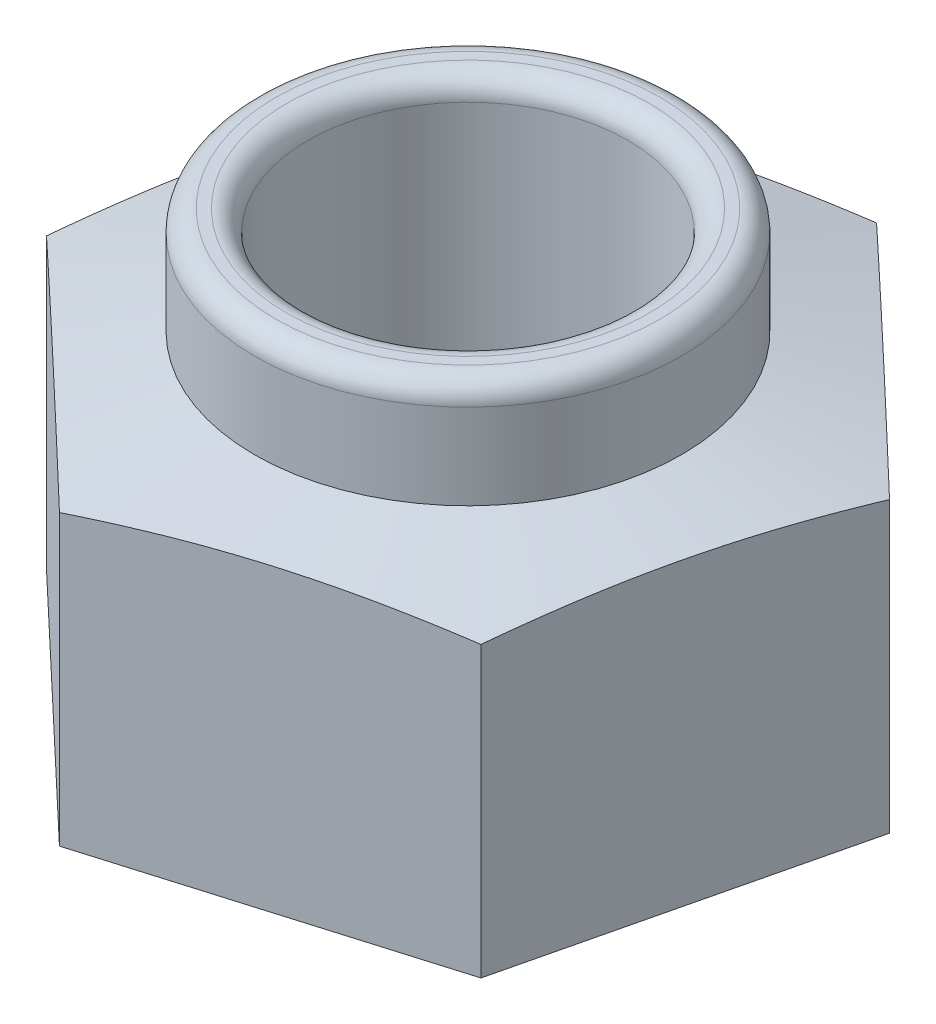
ISO-10303-21;
HEADER;
FILE_DESCRIPTION(('STEP AP214'),'2;1');
FILE_NAME('part.step','',(''),(''),'','','');
FILE_SCHEMA(('AUTOMOTIVE_DESIGN { 1 0 10303 214 1 1 1 1 }'));
ENDSEC;
DATA;
#1=APPLICATION_CONTEXT('core data for automotive mechanical design processes');
#2=APPLICATION_PROTOCOL_DEFINITION('international standard','automotive_design',2000,#1);
#3=PRODUCT_CONTEXT('',#1,'mechanical');
#4=PRODUCT('Part','Part','',(#3));
#5=PRODUCT_RELATED_PRODUCT_CATEGORY('part','',(#4));
#6=PRODUCT_DEFINITION_FORMATION('','',#4);
#7=PRODUCT_DEFINITION_CONTEXT('part definition',#1,'design');
#8=PRODUCT_DEFINITION('design','',#6,#7);
#9=PRODUCT_DEFINITION_SHAPE('','',#8);
#10=(LENGTH_UNIT() NAMED_UNIT(*) SI_UNIT(.MILLI.,.METRE.));
#11=(NAMED_UNIT(*) PLANE_ANGLE_UNIT() SI_UNIT($,.RADIAN.));
#12=(NAMED_UNIT(*) SI_UNIT($,.STERADIAN.) SOLID_ANGLE_UNIT());
#13=UNCERTAINTY_MEASURE_WITH_UNIT(LENGTH_MEASURE(1.E-05),#10,'distance_accuracy_value','');
#14=(GEOMETRIC_REPRESENTATION_CONTEXT(3) GLOBAL_UNCERTAINTY_ASSIGNED_CONTEXT((#13)) GLOBAL_UNIT_ASSIGNED_CONTEXT((#10,
#11,#12)) REPRESENTATION_CONTEXT('',''));
#15=CARTESIAN_POINT('',(0.,0.,0.));
#16=DIRECTION('',(0.,0.,1.));
#17=DIRECTION('',(1.,0.,0.));
#18=AXIS2_PLACEMENT_3D('',#15,#16,#17);
#19=CARTESIAN_POINT('',(0.,4.,0.));
#20=DIRECTION('',(0.,1.,0.));
#21=DIRECTION('',(0.,0.,1.));
#22=AXIS2_PLACEMENT_3D('',#19,#20,#21);
#23=PLANE('',#22);
#24=CARTESIAN_POINT('',(0.,4.,0.));
#25=DIRECTION('',(0.,1.,0.));
#26=DIRECTION('',(0.,0.,1.));
#27=AXIS2_PLACEMENT_3D('',#24,#25,#26);
#28=CIRCLE('',#27,1.7);
#29=CARTESIAN_POINT('',(0.,4.,1.7));
#30=VERTEX_POINT('',#29);
#31=EDGE_CURVE('E52',#30,#30,#28,.F.);
#32=ORIENTED_EDGE('',*,*,#31,.T.);
#33=EDGE_LOOP('',(#32));
#34=FACE_BOUND('',#33,.T.);
#35=CARTESIAN_POINT('',(0.,4.,0.));
#36=DIRECTION('',(0.,1.,0.));
#37=DIRECTION('',(0.,0.,1.));
#38=AXIS2_PLACEMENT_3D('',#35,#36,#37);
#39=CIRCLE('',#38,1.8);
#40=CARTESIAN_POINT('',(0.,4.,1.8));
#41=VERTEX_POINT('',#40);
#42=EDGE_CURVE('E350',#41,#41,#39,.T.);
#43=ORIENTED_EDGE('',*,*,#42,.T.);
#44=EDGE_LOOP('',(#43));
#45=FACE_BOUND('',#44,.T.);
#46=ADVANCED_FACE('F43',(#34,#45),#23,.T.);
#47=CARTESIAN_POINT('',(0.,0.,0.));
#48=DIRECTION('',(0.,1.,0.));
#49=DIRECTION('',(0.,0.,1.));
#50=AXIS2_PLACEMENT_3D('',#47,#48,#49);
#51=PLANE('',#50);
#52=DIRECTION('',(0.958580678360434,0.,-0.284821142252556));
#53=VECTOR('',#52,1.);
#54=CARTESIAN_POINT('',(-0.738693093706741,0.,3.08831116415482));
#55=LINE('',#54,#53);
#56=CARTESIAN_POINT('',(-0.738693093706741,0.,3.08831116415482));
#57=VERTEX_POINT('',#56);
#58=CARTESIAN_POINT('',(2.3052093760958,0.,2.18388256682757));
#59=VERTEX_POINT('',#58);
#60=EDGE_CURVE('E236',#57,#59,#55,.T.);
#61=ORIENTED_EDGE('',*,*,#60,.F.);
#62=DIRECTION('',(0.725952683905831,0.,0.687744647910778));
#63=VECTOR('',#62,1.);
#64=CARTESIAN_POINT('',(-3.04390246980254,0.,0.904428597327254));
#65=LINE('',#64,#63);
#66=CARTESIAN_POINT('',(-3.04390246980254,0.,0.904428597327254));
#67=VERTEX_POINT('',#66);
#68=EDGE_CURVE('E114',#67,#57,#65,.T.);
#69=ORIENTED_EDGE('',*,*,#68,.F.);
#70=DIRECTION('',(-0.232627994454602,0.,0.972565790163334));
#71=VECTOR('',#70,1.);
#72=CARTESIAN_POINT('',(-2.3052093760958,0.,-2.18388256682757));
#73=LINE('',#72,#71);
#74=CARTESIAN_POINT('',(-2.3052093760958,0.,-2.18388256682757));
#75=VERTEX_POINT('',#74);
#76=EDGE_CURVE('E123',#75,#67,#73,.T.);
#77=ORIENTED_EDGE('',*,*,#76,.F.);
#78=DIRECTION('',(-0.958580678360434,0.,0.284821142252556));
#79=VECTOR('',#78,1.);
#80=CARTESIAN_POINT('',(0.73869309370674,0.,-3.08831116415482));
#81=LINE('',#80,#79);
#82=CARTESIAN_POINT('',(0.73869309370674,0.,-3.08831116415482));
#83=VERTEX_POINT('',#82);
#84=EDGE_CURVE('E248',#83,#75,#81,.T.);
#85=ORIENTED_EDGE('',*,*,#84,.F.);
#86=DIRECTION('',(-0.725952683905832,0.,-0.687744647910778));
#87=VECTOR('',#86,1.);
#88=CARTESIAN_POINT('',(3.04390246980254,0.,-0.904428597327254));
#89=LINE('',#88,#87);
#90=CARTESIAN_POINT('',(3.04390246980254,0.,-0.904428597327254));
#91=VERTEX_POINT('',#90);
#92=EDGE_CURVE('E244',#91,#83,#89,.T.);
#93=ORIENTED_EDGE('',*,*,#92,.F.);
#94=DIRECTION('',(0.232627994454602,0.,-0.972565790163334));
#95=VECTOR('',#94,1.);
#96=CARTESIAN_POINT('',(2.3052093760958,0.,2.18388256682757));
#97=LINE('',#96,#95);
#98=EDGE_CURVE('E238',#59,#91,#97,.T.);
#99=ORIENTED_EDGE('',*,*,#98,.F.);
#100=EDGE_LOOP('',(#61,#69,#77,#85,#93,#99));
#101=FACE_BOUND('',#100,.T.);
#102=CARTESIAN_POINT('',(0.,0.,0.));
#103=DIRECTION('',(0.,1.,0.));
#104=DIRECTION('',(0.,0.,1.));
#105=AXIS2_PLACEMENT_3D('',#102,#103,#104);
#106=CIRCLE('',#105,1.5);
#107=CARTESIAN_POINT('',(0.,0.,1.5));
#108=VERTEX_POINT('',#107);
#109=EDGE_CURVE('E109',#108,#108,#106,.T.);
#110=ORIENTED_EDGE('',*,*,#109,.T.);
#111=EDGE_LOOP('',(#110));
#112=FACE_BOUND('',#111,.T.);
#113=ADVANCED_FACE('F200',(#101,#112),#51,.F.);
#114=CARTESIAN_POINT('',(-0.738693093706741,4.,3.08831116415482));
#115=DIRECTION('',(-0.284821142252556,0.,-0.958580678360434));
#116=DIRECTION('',(-0.958580678360434,0.,0.284821142252556));
#117=AXIS2_PLACEMENT_3D('',#114,#115,#116);
#118=PLANE('',#117);
#119=DIRECTION('',(0.,-1.,0.));
#120=VECTOR('',#119,1.);
#121=CARTESIAN_POINT('',(2.3052093760958,4.,2.18388256682757));
#122=LINE('',#121,#120);
#123=CARTESIAN_POINT('',(2.3052093760958,2.70614337986426,2.18388256682757));
#124=VERTEX_POINT('',#123);
#125=EDGE_CURVE('E104',#124,#59,#122,.T.);
#126=ORIENTED_EDGE('',*,*,#125,.F.);
#127=CARTESIAN_POINT('',(2.3054093760958,2.70611729835387,2.18382314123123));
#128=CARTESIAN_POINT('',(2.17893284561812,2.72261795531477,2.22140285746378));
#129=CARTESIAN_POINT('',(2.05225623487109,2.73759320201303,2.25904202314294));
#130=CARTESIAN_POINT('',(1.79851339723578,2.76389778378225,2.33443612035895));
#131=CARTESIAN_POINT('',(1.6714470492696,2.77522583815263,2.37219108787143));
#132=CARTESIAN_POINT('',(1.41759629569121,2.79358713781278,2.44761724993379));
#133=CARTESIAN_POINT('',(1.29081319279432,2.80063947237919,2.48528805741051));
#134=CARTESIAN_POINT('',(1.03710608892913,2.81009551496497,2.56067153712353));
#135=CARTESIAN_POINT('',(0.910182115061828,2.8125,2.59838420130736));
#136=CARTESIAN_POINT('',(0.656334167327229,2.8125,2.67380952967503));
#137=CARTESIAN_POINT('',(0.52941019345993,2.81009551496497,2.71152219385886));
#138=CARTESIAN_POINT('',(0.275703089594735,2.80063947237919,2.78690567357187));
#139=CARTESIAN_POINT('',(0.148919986697843,2.79358713781278,2.82457648104859));
#140=CARTESIAN_POINT('',(-0.104930766880538,2.77522583815263,2.90000264311096));
#141=CARTESIAN_POINT('',(-0.231997114846719,2.76389778378225,2.93775761062344));
#142=CARTESIAN_POINT('',(-0.485739952482028,2.73759320201303,3.01315170783944));
#143=CARTESIAN_POINT('',(-0.612416563229059,2.72261795531477,3.05079087351861));
#144=CARTESIAN_POINT('',(-0.73889309370674,2.70611729835387,3.08837058975116));
#145=B_SPLINE_CURVE_WITH_KNOTS('',3,(#127,#128,#129,#130,#131,#132,#133,#134,#135,#136,#137,
#138,#139,#140,#141,#142,#143,#144),.UNSPECIFIED.,.F.,.F.,(4,2,2,2,2,2,2,2,4),(0.,
0.398925735360688,0.797991399895339,1.19526202760825,1.59246623488281,1.98967044215736,
2.38694106987027,2.78600673440492,3.18493246976561),.UNSPECIFIED.);
#146=CARTESIAN_POINT('',(-0.738693093706741,2.70614337986426,3.08831116415482));
#147=VERTEX_POINT('',#146);
#148=EDGE_CURVE('E98',#124,#147,#145,.T.);
#149=ORIENTED_EDGE('',*,*,#148,.T.);
#150=DIRECTION('',(0.,-1.,0.));
#151=VECTOR('',#150,1.);
#152=CARTESIAN_POINT('',(-0.738693093706741,4.,3.08831116415482));
#153=LINE('',#152,#151);
#154=EDGE_CURVE('E67',#147,#57,#153,.T.);
#155=ORIENTED_EDGE('',*,*,#154,.T.);
#156=ORIENTED_EDGE('',*,*,#60,.T.);
#157=EDGE_LOOP('',(#126,#149,#155,#156));
#158=FACE_BOUND('',#157,.T.);
#159=ADVANCED_FACE('F107',(#158),#118,.F.);
#160=CARTESIAN_POINT('',(2.3052093760958,4.,2.18388256682757));
#161=DIRECTION('',(-0.972565790163334,0.,-0.232627994454602));
#162=DIRECTION('',(-0.232627994454602,0.,0.972565790163334));
#163=AXIS2_PLACEMENT_3D('',#160,#161,#162);
#164=PLANE('',#163);
#165=DIRECTION('',(0.,-1.,0.));
#166=VECTOR('',#165,1.);
#167=CARTESIAN_POINT('',(3.04390246980254,4.,-0.904428597327254));
#168=LINE('',#167,#166);
#169=CARTESIAN_POINT('',(3.04390246980254,2.70614337986426,-0.904428597327254));
#170=VERTEX_POINT('',#169);
#171=EDGE_CURVE('E132',#170,#91,#168,.T.);
#172=ORIENTED_EDGE('',*,*,#171,.F.);
#173=CARTESIAN_POINT('',(3.04395030779906,2.70611767341389,-0.904628597327254));
#174=CARTESIAN_POINT('',(3.01325708925986,2.7226182760134,-0.77630709238016));
#175=CARTESIAN_POINT('',(2.98251531550682,2.7375934716992,-0.647782588907382));
#176=CARTESIAN_POINT('',(2.920937216566,2.76389796183793,-0.390338283489443));
#177=CARTESIAN_POINT('',(2.8901008619954,2.77522597560232,-0.261418358701273));
#178=CARTESIAN_POINT('',(2.82849657416042,2.79358720855293,-0.00386456335454738));
#179=CARTESIAN_POINT('',(2.79772895703582,2.80063951688934,0.124767985494024));
#180=CARTESIAN_POINT('',(2.73615952987269,2.81009552410906,0.382176036142485));
#181=CARTESIAN_POINT('',(2.70535772641093,2.8125,0.51095151044632));
#182=CARTESIAN_POINT('',(2.64375411948741,2.8125,0.768502459053991));
#183=CARTESIAN_POINT('',(2.61295231602565,2.81009552410906,0.897277933357826));
#184=CARTESIAN_POINT('',(2.55138288886251,2.80063951688934,1.15468598400629));
#185=CARTESIAN_POINT('',(2.52061527173792,2.79358720855293,1.28331853285486));
#186=CARTESIAN_POINT('',(2.45901098390293,2.77522597560232,1.54087232820158));
#187=CARTESIAN_POINT('',(2.42817462933233,2.76389796183793,1.66979225298975));
#188=CARTESIAN_POINT('',(2.36659653039152,2.7375934716992,1.92723655840769));
#189=CARTESIAN_POINT('',(2.33585475663848,2.7226182760134,2.05576106188047));
#190=CARTESIAN_POINT('',(2.30516153809927,2.70611767341389,2.18408256682757));
#191=B_SPLINE_CURVE_WITH_KNOTS('',3,(#173,#174,#175,#176,#177,#178,#179,#180,#181,#182,#183,
#184,#185,#186,#187,#188,#189,#190),.UNSPECIFIED.,.F.,.F.,(4,2,2,2,2,2,2,2,4),(0.,
0.398924975635594,0.797989879263441,1.19525975539557,1.5924632116571,1.98966666791863,
2.38693654405076,2.7860014476786,3.1849264233142),.UNSPECIFIED.);
#192=EDGE_CURVE('E110',#170,#124,#191,.T.);
#193=ORIENTED_EDGE('',*,*,#192,.T.);
#194=ORIENTED_EDGE('',*,*,#125,.T.);
#195=ORIENTED_EDGE('',*,*,#98,.T.);
#196=EDGE_LOOP('',(#172,#193,#194,#195));
#197=FACE_BOUND('',#196,.T.);
#198=ADVANCED_FACE('F192',(#197),#164,.F.);
#199=CARTESIAN_POINT('',(3.04390246980254,4.,-0.904428597327254));
#200=DIRECTION('',(-0.687744647910778,0.,0.725952683905832));
#201=DIRECTION('',(0.725952683905832,0.,0.687744647910778));
#202=AXIS2_PLACEMENT_3D('',#199,#200,#201);
#203=PLANE('',#202);
#204=DIRECTION('',(0.,-1.,0.));
#205=VECTOR('',#204,1.);
#206=CARTESIAN_POINT('',(0.73869309370674,4.,-3.08831116415482));
#207=LINE('',#206,#205);
#208=CARTESIAN_POINT('',(0.73869309370674,2.70614337986426,-3.08831116415482));
#209=VERTEX_POINT('',#208);
#210=EDGE_CURVE('E129',#209,#83,#207,.T.);
#211=ORIENTED_EDGE('',*,*,#210,.F.);
#212=CARTESIAN_POINT('',(0.73849309370674,2.70610894011739,-3.08850063783903));
#213=CARTESIAN_POINT('',(0.834280365729109,2.72261080851929,-2.99775480118626));
#214=CARTESIAN_POINT('',(0.930219175819193,2.73758719203048,-2.90686540215355));
#215=CARTESIAN_POINT('',(1.12239189238977,2.76389381578885,-2.72480703908669));
#216=CARTESIAN_POINT('',(1.21862589058746,2.77522277506709,-2.63363798816257));
#217=CARTESIAN_POINT('',(1.41088034146279,2.79358556135694,-2.45150219259646));
#218=CARTESIAN_POINT('',(1.50689980738205,2.80063848046294,-2.36053638277822));
#219=CARTESIAN_POINT('',(1.69904545647225,2.81009531118718,-2.17850366258751));
#220=CARTESIAN_POINT('',(1.79517161911344,2.8125,-2.08743677166427));
#221=CARTESIAN_POINT('',(1.98742394439583,2.8125,-1.9053029898178));
#222=CARTESIAN_POINT('',(2.08355010703703,2.81009531118718,-1.81423609889456));
#223=CARTESIAN_POINT('',(2.27569575612723,2.80063848046294,-1.63220337870385));
#224=CARTESIAN_POINT('',(2.37171522204648,2.79358556135694,-1.54123756888561));
#225=CARTESIAN_POINT('',(2.56396967292182,2.77522277506709,-1.35910177331951));
#226=CARTESIAN_POINT('',(2.6602036711195,2.76389381578885,-1.26793272239539));
#227=CARTESIAN_POINT('',(2.85237638769008,2.73758719203048,-1.08587435932852));
#228=CARTESIAN_POINT('',(2.94831519778017,2.72261080851929,-0.994984960295814));
#229=CARTESIAN_POINT('',(3.04410246980254,2.70610894011739,-0.904239123643044));
#230=B_SPLINE_CURVE_WITH_KNOTS('',3,(#212,#213,#214,#215,#216,#217,#218,#219,#220,#221,#222,
#223,#224,#225,#226,#227,#228,#229),.UNSPECIFIED.,.F.,.F.,(4,2,2,2,2,2,2,2,4),(0.,
0.398942665609927,0.798025286729763,1.1953126631931,1.59253360656462,1.98975454993615,
2.38704192639948,2.78612454751932,3.18506721312925),.UNSPECIFIED.);
#231=EDGE_CURVE('E173',#209,#170,#230,.T.);
#232=ORIENTED_EDGE('',*,*,#231,.T.);
#233=ORIENTED_EDGE('',*,*,#171,.T.);
#234=ORIENTED_EDGE('',*,*,#92,.T.);
#235=EDGE_LOOP('',(#211,#232,#233,#234));
#236=FACE_BOUND('',#235,.T.);
#237=ADVANCED_FACE('F195',(#236),#203,.F.);
#238=CARTESIAN_POINT('',(0.73869309370674,4.,-3.08831116415482));
#239=DIRECTION('',(0.284821142252556,0.,0.958580678360434));
#240=DIRECTION('',(0.958580678360434,0.,-0.284821142252556));
#241=AXIS2_PLACEMENT_3D('',#238,#239,#240);
#242=PLANE('',#241);
#243=DIRECTION('',(0.,-1.,0.));
#244=VECTOR('',#243,1.);
#245=CARTESIAN_POINT('',(-2.3052093760958,4.,-2.18388256682757));
#246=LINE('',#245,#244);
#247=CARTESIAN_POINT('',(-2.3052093760958,2.70614337986426,-2.18388256682757));
#248=VERTEX_POINT('',#247);
#249=EDGE_CURVE('E121',#248,#75,#246,.T.);
#250=ORIENTED_EDGE('',*,*,#249,.F.);
#251=CARTESIAN_POINT('',(-2.3054093760958,2.70611729835387,-2.18382314123123));
#252=CARTESIAN_POINT('',(-2.17893284561812,2.72261795531477,-2.22140285746378));
#253=CARTESIAN_POINT('',(-2.05225623487109,2.73759320201303,-2.25904202314294));
#254=CARTESIAN_POINT('',(-1.79851339723578,2.76389778378225,-2.33443612035895));
#255=CARTESIAN_POINT('',(-1.6714470492696,2.77522583815263,-2.37219108787143));
#256=CARTESIAN_POINT('',(-1.41759629569121,2.79358713781278,-2.4476172499338));
#257=CARTESIAN_POINT('',(-1.29081319279432,2.80063947237919,-2.48528805741051));
#258=CARTESIAN_POINT('',(-1.03710608892913,2.81009551496497,-2.56067153712353));
#259=CARTESIAN_POINT('',(-0.910182115061829,2.8125,-2.59838420130736));
#260=CARTESIAN_POINT('',(-0.65633416732723,2.8125,-2.67380952967503));
#261=CARTESIAN_POINT('',(-0.52941019345993,2.81009551496497,-2.71152219385886));
#262=CARTESIAN_POINT('',(-0.275703089594735,2.80063947237919,-2.78690567357187));
#263=CARTESIAN_POINT('',(-0.148919986697844,2.79358713781278,-2.82457648104859));
#264=CARTESIAN_POINT('',(0.104930766880538,2.77522583815263,-2.90000264311096));
#265=CARTESIAN_POINT('',(0.231997114846718,2.76389778378225,-2.93775761062344));
#266=CARTESIAN_POINT('',(0.485739952482026,2.73759320201303,-3.01315170783944));
#267=CARTESIAN_POINT('',(0.612416563229058,2.72261795531477,-3.05079087351861));
#268=CARTESIAN_POINT('',(0.738893093706739,2.70611729835387,-3.08837058975116));
#269=B_SPLINE_CURVE_WITH_KNOTS('',3,(#251,#252,#253,#254,#255,#256,#257,#258,#259,#260,#261,
#262,#263,#264,#265,#266,#267,#268),.UNSPECIFIED.,.F.,.F.,(4,2,2,2,2,2,2,2,4),(0.,
0.398925735360688,0.797991399895338,1.19526202760825,1.59246623488281,1.98967044215736,
2.38694106987027,2.78600673440492,3.18493246976561),.UNSPECIFIED.);
#270=EDGE_CURVE('E166',#248,#209,#269,.T.);
#271=ORIENTED_EDGE('',*,*,#270,.T.);
#272=ORIENTED_EDGE('',*,*,#210,.T.);
#273=ORIENTED_EDGE('',*,*,#84,.T.);
#274=EDGE_LOOP('',(#250,#271,#272,#273));
#275=FACE_BOUND('',#274,.T.);
#276=ADVANCED_FACE('F273',(#275),#242,.F.);
#277=CARTESIAN_POINT('',(-2.3052093760958,4.,-2.18388256682757));
#278=DIRECTION('',(0.972565790163334,0.,0.232627994454602));
#279=DIRECTION('',(0.232627994454602,0.,-0.972565790163334));
#280=AXIS2_PLACEMENT_3D('',#277,#278,#279);
#281=PLANE('',#280);
#282=DIRECTION('',(0.,-1.,0.));
#283=VECTOR('',#282,1.);
#284=CARTESIAN_POINT('',(-3.04390246980254,4.,0.904428597327254));
#285=LINE('',#284,#283);
#286=CARTESIAN_POINT('',(-3.04390246980254,2.70614337986426,0.904428597327254));
#287=VERTEX_POINT('',#286);
#288=EDGE_CURVE('E117',#287,#67,#285,.T.);
#289=ORIENTED_EDGE('',*,*,#288,.F.);
#290=CARTESIAN_POINT('',(-3.04395030779906,2.70611767341389,0.904628597327254));
#291=CARTESIAN_POINT('',(-3.01325708925986,2.7226182760134,0.77630709238016));
#292=CARTESIAN_POINT('',(-2.98251531550682,2.7375934716992,0.647782588907382));
#293=CARTESIAN_POINT('',(-2.920937216566,2.76389796183793,0.390338283489442));
#294=CARTESIAN_POINT('',(-2.8901008619954,2.77522597560232,0.261418358701273));
#295=CARTESIAN_POINT('',(-2.82849657416042,2.79358720855293,0.00386456335454668));
#296=CARTESIAN_POINT('',(-2.79772895703582,2.80063951688934,-0.124767985494025));
#297=CARTESIAN_POINT('',(-2.73615952987269,2.81009552410906,-0.382176036142486));
#298=CARTESIAN_POINT('',(-2.70535772641093,2.8125,-0.510951510446321));
#299=CARTESIAN_POINT('',(-2.64375411948741,2.8125,-0.768502459053992));
#300=CARTESIAN_POINT('',(-2.61295231602565,2.81009552410906,-0.897277933357827));
#301=CARTESIAN_POINT('',(-2.55138288886251,2.80063951688934,-1.15468598400629));
#302=CARTESIAN_POINT('',(-2.52061527173792,2.79358720855293,-1.28331853285486));
#303=CARTESIAN_POINT('',(-2.45901098390293,2.77522597560232,-1.54087232820159));
#304=CARTESIAN_POINT('',(-2.42817462933233,2.76389796183793,-1.66979225298976));
#305=CARTESIAN_POINT('',(-2.36659653039152,2.7375934716992,-1.9272365584077));
#306=CARTESIAN_POINT('',(-2.33585475663848,2.7226182760134,-2.05576106188047));
#307=CARTESIAN_POINT('',(-2.30516153809927,2.70611767341389,-2.18408256682757));
#308=B_SPLINE_CURVE_WITH_KNOTS('',3,(#290,#291,#292,#293,#294,#295,#296,#297,#298,#299,#300,
#301,#302,#303,#304,#305,#306,#307),.UNSPECIFIED.,.F.,.F.,(4,2,2,2,2,2,2,2,4),(0.,
0.398924975635594,0.797989879263441,1.19525975539557,1.5924632116571,1.98966666791863,
2.38693654405076,2.7860014476786,3.1849264233142),.UNSPECIFIED.);
#309=EDGE_CURVE('E59',#287,#248,#308,.T.);
#310=ORIENTED_EDGE('',*,*,#309,.T.);
#311=ORIENTED_EDGE('',*,*,#249,.T.);
#312=ORIENTED_EDGE('',*,*,#76,.T.);
#313=EDGE_LOOP('',(#289,#310,#311,#312));
#314=FACE_BOUND('',#313,.T.);
#315=ADVANCED_FACE('F228',(#314),#281,.F.);
#316=CARTESIAN_POINT('',(-3.04390246980254,4.,0.904428597327254));
#317=DIRECTION('',(0.687744647910778,0.,-0.725952683905832));
#318=DIRECTION('',(-0.725952683905832,0.,-0.687744647910778));
#319=AXIS2_PLACEMENT_3D('',#316,#317,#318);
#320=PLANE('',#319);
#321=ORIENTED_EDGE('',*,*,#154,.F.);
#322=CARTESIAN_POINT('',(-0.738493093706741,2.70610894011739,3.08850063783903));
#323=CARTESIAN_POINT('',(-0.83428036572911,2.72261080851929,2.99775480118626));
#324=CARTESIAN_POINT('',(-0.930219175819194,2.73758719203048,2.90686540215355));
#325=CARTESIAN_POINT('',(-1.12239189238977,2.76389381578885,2.72480703908669));
#326=CARTESIAN_POINT('',(-1.21862589058746,2.77522277506709,2.63363798816257));
#327=CARTESIAN_POINT('',(-1.41088034146279,2.79358556135694,2.45150219259646));
#328=CARTESIAN_POINT('',(-1.50689980738205,2.80063848046294,2.36053638277822));
#329=CARTESIAN_POINT('',(-1.69904545647225,2.81009531118718,2.17850366258751));
#330=CARTESIAN_POINT('',(-1.79517161911344,2.8125,2.08743677166427));
#331=CARTESIAN_POINT('',(-1.98742394439583,2.8125,1.9053029898178));
#332=CARTESIAN_POINT('',(-2.08355010703703,2.81009531118718,1.81423609889456));
#333=CARTESIAN_POINT('',(-2.27569575612723,2.80063848046294,1.63220337870385));
#334=CARTESIAN_POINT('',(-2.37171522204648,2.79358556135694,1.54123756888561));
#335=CARTESIAN_POINT('',(-2.56396967292182,2.77522277506709,1.35910177331951));
#336=CARTESIAN_POINT('',(-2.6602036711195,2.76389381578885,1.26793272239539));
#337=CARTESIAN_POINT('',(-2.85237638769008,2.73758719203048,1.08587435932852));
#338=CARTESIAN_POINT('',(-2.94831519778017,2.72261080851929,0.994984960295813));
#339=CARTESIAN_POINT('',(-3.04410246980254,2.70610894011739,0.904239123643043));
#340=B_SPLINE_CURVE_WITH_KNOTS('',3,(#322,#323,#324,#325,#326,#327,#328,#329,#330,#331,#332,
#333,#334,#335,#336,#337,#338,#339),.UNSPECIFIED.,.F.,.F.,(4,2,2,2,2,2,2,2,4),(0.,
0.398942665609928,0.798025286729762,1.1953126631931,1.59253360656462,1.98975454993615,
2.38704192639948,2.78612454751932,3.18506721312925),.UNSPECIFIED.);
#341=EDGE_CURVE('E96',#147,#287,#340,.T.);
#342=ORIENTED_EDGE('',*,*,#341,.T.);
#343=ORIENTED_EDGE('',*,*,#288,.T.);
#344=ORIENTED_EDGE('',*,*,#68,.T.);
#345=EDGE_LOOP('',(#321,#342,#343,#344));
#346=FACE_BOUND('',#345,.T.);
#347=ADVANCED_FACE('F112',(#346),#320,.F.);
#348=CARTESIAN_POINT('',(0.,4.,0.));
#349=DIRECTION('',(0.,-1.,0.));
#350=DIRECTION('',(0.,0.,-1.));
#351=AXIS2_PLACEMENT_3D('',#348,#349,#350);
#352=CYLINDRICAL_SURFACE('',#351,1.5);
#353=CARTESIAN_POINT('',(0.,3.8,0.));
#354=DIRECTION('',(0.,1.,0.));
#355=DIRECTION('',(0.,0.,1.));
#356=AXIS2_PLACEMENT_3D('',#353,#354,#355);
#357=CIRCLE('',#356,1.5);
#358=CARTESIAN_POINT('',(0.,3.8,1.5));
#359=VERTEX_POINT('',#358);
#360=EDGE_CURVE('E103',#359,#359,#357,.T.);
#361=ORIENTED_EDGE('',*,*,#360,.T.);
#362=EDGE_LOOP('',(#361));
#363=FACE_BOUND('',#362,.T.);
#364=ORIENTED_EDGE('',*,*,#109,.F.);
#365=EDGE_LOOP('',(#364));
#366=FACE_BOUND('',#365,.T.);
#367=ADVANCED_FACE('F151',(#363,#366),#352,.F.);
#368=CARTESIAN_POINT('',(0.,2.5,0.));
#369=DIRECTION('',(0.,-1.,0.));
#370=DIRECTION('',(0.,0.,-1.));
#371=AXIS2_PLACEMENT_3D('',#368,#369,#370);
#372=CONICAL_SURFACE('',#371,4.,1.32581766366803);
#373=CARTESIAN_POINT('',(0.,3.,0.));
#374=DIRECTION('',(0.,1.,0.));
#375=DIRECTION('',(0.,0.,1.));
#376=AXIS2_PLACEMENT_3D('',#373,#374,#375);
#377=CIRCLE('',#376,2.);
#378=CARTESIAN_POINT('',(0.,3.,2.));
#379=VERTEX_POINT('',#378);
#380=EDGE_CURVE('E268',#379,#379,#377,.T.);
#381=ORIENTED_EDGE('',*,*,#380,.F.);
#382=EDGE_LOOP('',(#381));
#383=FACE_BOUND('',#382,.T.);
#384=ORIENTED_EDGE('',*,*,#192,.F.);
#385=ORIENTED_EDGE('',*,*,#231,.F.);
#386=ORIENTED_EDGE('',*,*,#270,.F.);
#387=ORIENTED_EDGE('',*,*,#309,.F.);
#388=ORIENTED_EDGE('',*,*,#341,.F.);
#389=ORIENTED_EDGE('',*,*,#148,.F.);
#390=EDGE_LOOP('',(#384,#385,#386,#387,#388,#389));
#391=FACE_BOUND('',#390,.T.);
#392=ADVANCED_FACE('F97',(#383,#391),#372,.T.);
#393=CARTESIAN_POINT('',(0.,4.,0.));
#394=DIRECTION('',(0.,1.,0.));
#395=DIRECTION('',(0.,0.,1.));
#396=AXIS2_PLACEMENT_3D('',#393,#394,#395);
#397=CYLINDRICAL_SURFACE('',#396,2.);
#398=CARTESIAN_POINT('',(0.,3.8,0.));
#399=DIRECTION('',(0.,1.,0.));
#400=DIRECTION('',(0.,0.,1.));
#401=AXIS2_PLACEMENT_3D('',#398,#399,#400);
#402=CIRCLE('',#401,2.);
#403=CARTESIAN_POINT('',(0.,3.8,2.));
#404=VERTEX_POINT('',#403);
#405=EDGE_CURVE('E11',#404,#404,#402,.F.);
#406=ORIENTED_EDGE('',*,*,#405,.T.);
#407=EDGE_LOOP('',(#406));
#408=FACE_BOUND('',#407,.T.);
#409=ORIENTED_EDGE('',*,*,#380,.T.);
#410=EDGE_LOOP('',(#409));
#411=FACE_BOUND('',#410,.T.);
#412=ADVANCED_FACE('F150',(#408,#411),#397,.T.);
#413=CARTESIAN_POINT('',(0.,3.8,0.));
#414=DIRECTION('',(0.,1.,0.));
#415=DIRECTION('',(0.,0.,1.));
#416=AXIS2_PLACEMENT_3D('',#413,#414,#415);
#417=TOROIDAL_SURFACE('',#416,1.7,0.2);
#418=ORIENTED_EDGE('',*,*,#31,.F.);
#419=EDGE_LOOP('',(#418));
#420=FACE_BOUND('',#419,.T.);
#421=ORIENTED_EDGE('',*,*,#360,.F.);
#422=EDGE_LOOP('',(#421));
#423=FACE_BOUND('',#422,.T.);
#424=ADVANCED_FACE('F201',(#420,#423),#417,.T.);
#425=CARTESIAN_POINT('',(0.,3.8,0.));
#426=DIRECTION('',(0.,1.,0.));
#427=DIRECTION('',(0.,0.,1.));
#428=AXIS2_PLACEMENT_3D('',#425,#426,#427);
#429=TOROIDAL_SURFACE('',#428,1.8,0.2);
#430=ORIENTED_EDGE('',*,*,#405,.F.);
#431=EDGE_LOOP('',(#430));
#432=FACE_BOUND('',#431,.T.);
#433=ORIENTED_EDGE('',*,*,#42,.F.);
#434=EDGE_LOOP('',(#433));
#435=FACE_BOUND('',#434,.T.);
#436=ADVANCED_FACE('F45',(#432,#435),#429,.T.);
#437=CLOSED_SHELL('',(#46,#113,#159,#198,#237,#276,#315,#347,#367,#392,#412,#424,#436));
#438=MANIFOLD_SOLID_BREP('B2',#437);
#439=ADVANCED_BREP_SHAPE_REPRESENTATION('',(#18,#438),#14);
#440=SHAPE_DEFINITION_REPRESENTATION(#9,#439);
ENDSEC;
END-ISO-10303-21;
